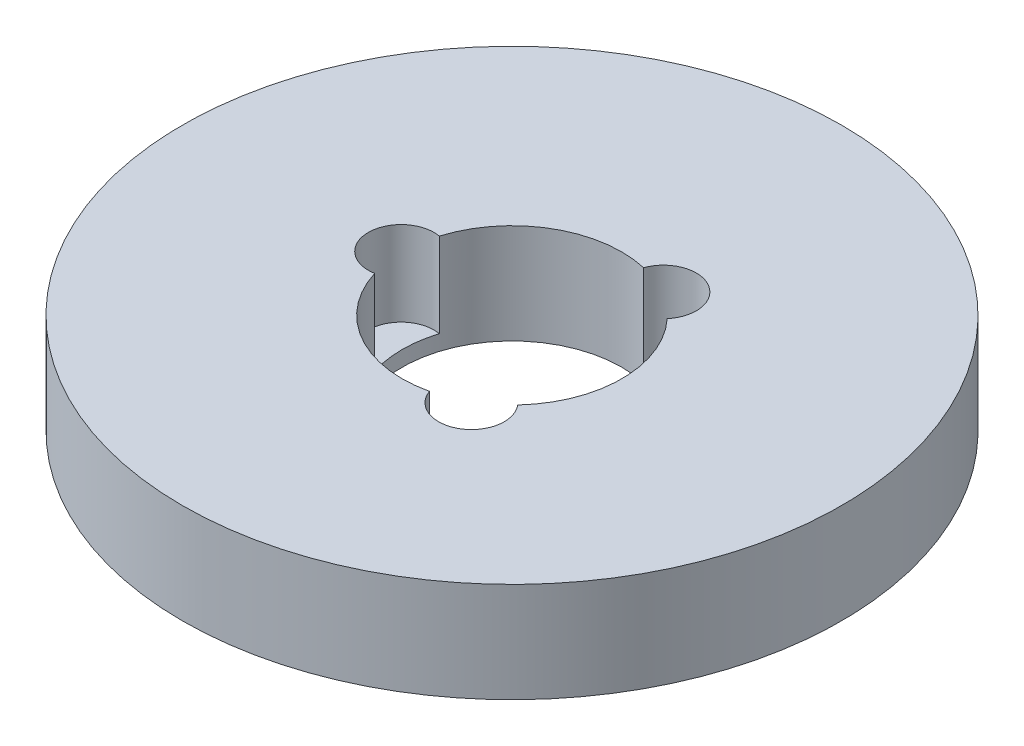
ISO-10303-21;
HEADER;
FILE_DESCRIPTION(('STEP AP214'),'2;1');
FILE_NAME('part.step','',(''),(''),'','','');
FILE_SCHEMA(('AUTOMOTIVE_DESIGN { 1 0 10303 214 1 1 1 1 }'));
ENDSEC;
DATA;
#1=APPLICATION_CONTEXT('core data for automotive mechanical design processes');
#2=APPLICATION_PROTOCOL_DEFINITION('international standard','automotive_design',2000,#1);
#3=PRODUCT_CONTEXT('',#1,'mechanical');
#4=PRODUCT('Part','Part','',(#3));
#5=PRODUCT_RELATED_PRODUCT_CATEGORY('part','',(#4));
#6=PRODUCT_DEFINITION_FORMATION('','',#4);
#7=PRODUCT_DEFINITION_CONTEXT('part definition',#1,'design');
#8=PRODUCT_DEFINITION('design','',#6,#7);
#9=PRODUCT_DEFINITION_SHAPE('','',#8);
#10=(LENGTH_UNIT() NAMED_UNIT(*) SI_UNIT(.MILLI.,.METRE.));
#11=(NAMED_UNIT(*) PLANE_ANGLE_UNIT() SI_UNIT($,.RADIAN.));
#12=(NAMED_UNIT(*) SI_UNIT($,.STERADIAN.) SOLID_ANGLE_UNIT());
#13=UNCERTAINTY_MEASURE_WITH_UNIT(LENGTH_MEASURE(1.E-05),#10,'distance_accuracy_value','');
#14=(GEOMETRIC_REPRESENTATION_CONTEXT(3) GLOBAL_UNCERTAINTY_ASSIGNED_CONTEXT((#13)) GLOBAL_UNIT_ASSIGNED_CONTEXT((#10,
#11,#12)) REPRESENTATION_CONTEXT('',''));
#15=CARTESIAN_POINT('',(0.,0.,0.));
#16=DIRECTION('',(0.,0.,1.));
#17=DIRECTION('',(1.,0.,0.));
#18=AXIS2_PLACEMENT_3D('',#15,#16,#17);
#19=CARTESIAN_POINT('',(0.,25.,0.));
#20=DIRECTION('',(0.,-1.,0.));
#21=DIRECTION('',(0.,0.,-1.));
#22=AXIS2_PLACEMENT_3D('',#19,#20,#21);
#23=CYLINDRICAL_SURFACE('',#22,82.5);
#24=CARTESIAN_POINT('',(0.,25.,0.));
#25=DIRECTION('',(0.,1.,0.));
#26=DIRECTION('',(0.,0.,1.));
#27=AXIS2_PLACEMENT_3D('',#24,#25,#26);
#28=CIRCLE('',#27,82.5);
#29=CARTESIAN_POINT('',(0.,25.,82.5));
#30=VERTEX_POINT('',#29);
#31=EDGE_CURVE('E126',#30,#30,#28,.T.);
#32=ORIENTED_EDGE('',*,*,#31,.F.);
#33=EDGE_LOOP('',(#32));
#34=FACE_BOUND('',#33,.T.);
#35=CARTESIAN_POINT('',(0.,0.,0.));
#36=DIRECTION('',(0.,1.,0.));
#37=DIRECTION('',(0.,0.,1.));
#38=AXIS2_PLACEMENT_3D('',#35,#36,#37);
#39=CIRCLE('',#38,82.5);
#40=CARTESIAN_POINT('',(0.,0.,82.5));
#41=VERTEX_POINT('',#40);
#42=EDGE_CURVE('E124',#41,#41,#39,.T.);
#43=ORIENTED_EDGE('',*,*,#42,.T.);
#44=EDGE_LOOP('',(#43));
#45=FACE_BOUND('',#44,.T.);
#46=ADVANCED_FACE('F39',(#34,#45),#23,.T.);
#47=CARTESIAN_POINT('',(0.,25.,0.));
#48=DIRECTION('',(0.,1.,0.));
#49=DIRECTION('',(0.,0.,1.));
#50=AXIS2_PLACEMENT_3D('',#47,#48,#49);
#51=PLANE('',#50);
#52=CARTESIAN_POINT('',(13.8765047934647,25.,24.0348113337537));
#53=DIRECTION('',(0.,1.,0.));
#54=DIRECTION('',(0.866025403784436,0.,-0.500000000000004));
#55=AXIS2_PLACEMENT_3D('',#52,#53,#54);
#56=CIRCLE('',#55,8.21948386021427);
#57=CARTESIAN_POINT('',(6.13832277785087,25.,26.8061745401114));
#58=VERTEX_POINT('',#57);
#59=CARTESIAN_POINT('',(20.1456667410909,25.,18.719030732303));
#60=VERTEX_POINT('',#59);
#61=EDGE_CURVE('E147',#58,#60,#56,.T.);
#62=ORIENTED_EDGE('',*,*,#61,.F.);
#63=CARTESIAN_POINT('',(0.,25.,0.));
#64=DIRECTION('',(0.,1.,0.));
#65=DIRECTION('',(0.,0.,1.));
#66=AXIS2_PLACEMENT_3D('',#63,#64,#65);
#67=CIRCLE('',#66,27.5);
#68=CARTESIAN_POINT('',(-26.2839895189415,25.,8.08714380780831));
#69=VERTEX_POINT('',#68);
#70=EDGE_CURVE('E118',#69,#58,#67,.T.);
#71=ORIENTED_EDGE('',*,*,#70,.F.);
#72=CARTESIAN_POINT('',(-27.7530095869292,25.,0.));
#73=DIRECTION('',(0.,1.,0.));
#74=DIRECTION('',(0.,0.,1.));
#75=AXIS2_PLACEMENT_3D('',#72,#73,#74);
#76=CIRCLE('',#75,8.21948386021427);
#77=CARTESIAN_POINT('',(-26.2839895189415,25.,-8.08714380780831));
#78=VERTEX_POINT('',#77);
#79=EDGE_CURVE('E113',#78,#69,#76,.T.);
#80=ORIENTED_EDGE('',*,*,#79,.F.);
#81=CARTESIAN_POINT('',(6.1383227778505,25.,-26.8061745401115));
#82=VERTEX_POINT('',#81);
#83=EDGE_CURVE('E106',#82,#78,#67,.T.);
#84=ORIENTED_EDGE('',*,*,#83,.F.);
#85=CARTESIAN_POINT('',(13.8765047934644,25.,-24.0348113337539));
#86=DIRECTION('',(0.,1.,0.));
#87=DIRECTION('',(-0.866025403784443,0.,-0.499999999999992));
#88=AXIS2_PLACEMENT_3D('',#85,#86,#87);
#89=CIRCLE('',#88,8.21948386021427);
#90=CARTESIAN_POINT('',(20.1456667410906,25.,-18.7190307323033));
#91=VERTEX_POINT('',#90);
#92=EDGE_CURVE('E90',#91,#82,#89,.T.);
#93=ORIENTED_EDGE('',*,*,#92,.F.);
#94=EDGE_CURVE('E116',#60,#91,#67,.T.);
#95=ORIENTED_EDGE('',*,*,#94,.F.);
#96=EDGE_LOOP('',(#62,#71,#80,#84,#93,#95));
#97=FACE_BOUND('',#96,.T.);
#98=ORIENTED_EDGE('',*,*,#31,.T.);
#99=EDGE_LOOP('',(#98));
#100=FACE_BOUND('',#99,.T.);
#101=ADVANCED_FACE('F115',(#97,#100),#51,.T.);
#102=CARTESIAN_POINT('',(0.,0.,0.));
#103=DIRECTION('',(0.,1.,0.));
#104=DIRECTION('',(0.,0.,1.));
#105=AXIS2_PLACEMENT_3D('',#102,#103,#104);
#106=PLANE('',#105);
#107=CARTESIAN_POINT('',(0.,0.,0.));
#108=DIRECTION('',(0.,1.,0.));
#109=DIRECTION('',(0.,0.,1.));
#110=AXIS2_PLACEMENT_3D('',#107,#108,#109);
#111=CIRCLE('',#110,27.5);
#112=CARTESIAN_POINT('',(0.,0.,27.5));
#113=VERTEX_POINT('',#112);
#114=EDGE_CURVE('E120',#113,#113,#111,.T.);
#115=ORIENTED_EDGE('',*,*,#114,.T.);
#116=EDGE_LOOP('',(#115));
#117=FACE_BOUND('',#116,.T.);
#118=ORIENTED_EDGE('',*,*,#42,.F.);
#119=EDGE_LOOP('',(#118));
#120=FACE_BOUND('',#119,.T.);
#121=ADVANCED_FACE('F164',(#117,#120),#106,.F.);
#122=CARTESIAN_POINT('',(0.,25.,0.));
#123=DIRECTION('',(0.,-1.,0.));
#124=DIRECTION('',(0.,0.,-1.));
#125=AXIS2_PLACEMENT_3D('',#122,#123,#124);
#126=CYLINDRICAL_SURFACE('',#125,27.5);
#127=DIRECTION('',(0.,1.,0.));
#128=VECTOR('',#127,1.);
#129=CARTESIAN_POINT('',(6.13832277785087,14.4231150029753,26.8061745401114));
#130=LINE('',#129,#128);
#131=CARTESIAN_POINT('',(6.13832277785087,3.84623000595068,26.8061745401114));
#132=VERTEX_POINT('',#131);
#133=EDGE_CURVE('E11',#132,#58,#130,.T.);
#134=ORIENTED_EDGE('',*,*,#133,.F.);
#135=CARTESIAN_POINT('',(0.,3.84623000595068,0.));
#136=DIRECTION('',(0.,1.,0.));
#137=DIRECTION('',(0.,0.,1.));
#138=AXIS2_PLACEMENT_3D('',#135,#136,#137);
#139=CIRCLE('',#138,27.5);
#140=CARTESIAN_POINT('',(20.1456667410909,3.84623000595068,18.719030732303));
#141=VERTEX_POINT('',#140);
#142=EDGE_CURVE('E144',#132,#141,#139,.T.);
#143=ORIENTED_EDGE('',*,*,#142,.T.);
#144=DIRECTION('',(0.,1.,0.));
#145=VECTOR('',#144,1.);
#146=CARTESIAN_POINT('',(20.1456667410909,14.4231150029753,18.719030732303));
#147=LINE('',#146,#145);
#148=EDGE_CURVE('E46',#60,#141,#147,.F.);
#149=ORIENTED_EDGE('',*,*,#148,.F.);
#150=ORIENTED_EDGE('',*,*,#94,.T.);
#151=DIRECTION('',(0.,1.,0.));
#152=VECTOR('',#151,1.);
#153=CARTESIAN_POINT('',(20.1456667410906,14.4231150029753,-18.7190307323033));
#154=LINE('',#153,#152);
#155=CARTESIAN_POINT('',(20.1456667410906,3.84623000595068,-18.7190307323033));
#156=VERTEX_POINT('',#155);
#157=EDGE_CURVE('E92',#156,#91,#154,.T.);
#158=ORIENTED_EDGE('',*,*,#157,.F.);
#159=CARTESIAN_POINT('',(0.,3.84623000595068,0.));
#160=DIRECTION('',(0.,1.,0.));
#161=DIRECTION('',(0.,0.,1.));
#162=AXIS2_PLACEMENT_3D('',#159,#160,#161);
#163=CIRCLE('',#162,27.5);
#164=CARTESIAN_POINT('',(6.1383227778505,3.84623000595068,-26.8061745401115));
#165=VERTEX_POINT('',#164);
#166=EDGE_CURVE('E107',#156,#165,#163,.T.);
#167=ORIENTED_EDGE('',*,*,#166,.T.);
#168=DIRECTION('',(0.,1.,0.));
#169=VECTOR('',#168,1.);
#170=CARTESIAN_POINT('',(6.13832277785049,14.4231150029753,-26.8061745401115));
#171=LINE('',#170,#169);
#172=EDGE_CURVE('E95',#82,#165,#171,.F.);
#173=ORIENTED_EDGE('',*,*,#172,.F.);
#174=ORIENTED_EDGE('',*,*,#83,.T.);
#175=DIRECTION('',(0.,1.,0.));
#176=VECTOR('',#175,1.);
#177=CARTESIAN_POINT('',(-26.2839895189415,14.4231150029753,-8.08714380780831));
#178=LINE('',#177,#176);
#179=CARTESIAN_POINT('',(-26.2839895189415,3.84623000595068,-8.08714380780831));
#180=VERTEX_POINT('',#179);
#181=EDGE_CURVE('E143',#180,#78,#178,.T.);
#182=ORIENTED_EDGE('',*,*,#181,.F.);
#183=CARTESIAN_POINT('',(0.,3.84623000595068,0.));
#184=DIRECTION('',(0.,1.,0.));
#185=DIRECTION('',(0.,0.,1.));
#186=AXIS2_PLACEMENT_3D('',#183,#184,#185);
#187=CIRCLE('',#186,27.5);
#188=CARTESIAN_POINT('',(-26.2839895189415,3.84623000595068,8.08714380780831));
#189=VERTEX_POINT('',#188);
#190=EDGE_CURVE('E132',#180,#189,#187,.T.);
#191=ORIENTED_EDGE('',*,*,#190,.T.);
#192=DIRECTION('',(0.,1.,0.));
#193=VECTOR('',#192,1.);
#194=CARTESIAN_POINT('',(-26.2839895189415,14.4231150029753,8.08714380780831));
#195=LINE('',#194,#193);
#196=EDGE_CURVE('E137',#69,#189,#195,.F.);
#197=ORIENTED_EDGE('',*,*,#196,.F.);
#198=ORIENTED_EDGE('',*,*,#70,.T.);
#199=EDGE_LOOP('',(#134,#143,#149,#150,#158,#167,#173,#174,#182,#191,#197,#198));
#200=FACE_BOUND('',#199,.T.);
#201=ORIENTED_EDGE('',*,*,#114,.F.);
#202=EDGE_LOOP('',(#201));
#203=FACE_BOUND('',#202,.T.);
#204=ADVANCED_FACE('F103',(#200,#203),#126,.F.);
#205=CARTESIAN_POINT('',(-27.7530095869292,3.84623000595068,0.));
#206=DIRECTION('',(0.,1.,0.));
#207=DIRECTION('',(0.,0.,1.));
#208=AXIS2_PLACEMENT_3D('',#205,#206,#207);
#209=CYLINDRICAL_SURFACE('',#208,8.21948386021427);
#210=ORIENTED_EDGE('',*,*,#181,.T.);
#211=ORIENTED_EDGE('',*,*,#79,.T.);
#212=ORIENTED_EDGE('',*,*,#196,.T.);
#213=CARTESIAN_POINT('',(-27.7530095869292,3.84623000595068,0.));
#214=DIRECTION('',(0.,1.,0.));
#215=DIRECTION('',(0.,0.,1.));
#216=AXIS2_PLACEMENT_3D('',#213,#214,#215);
#217=CIRCLE('',#216,8.21948386021427);
#218=EDGE_CURVE('E121',#180,#189,#217,.T.);
#219=ORIENTED_EDGE('',*,*,#218,.F.);
#220=EDGE_LOOP('',(#210,#211,#212,#219));
#221=FACE_BOUND('',#220,.T.);
#222=ADVANCED_FACE('F174',(#221),#209,.F.);
#223=CARTESIAN_POINT('',(-27.7530095869292,3.84623000595068,0.));
#224=DIRECTION('',(0.,1.,0.));
#225=DIRECTION('',(0.,0.,1.));
#226=AXIS2_PLACEMENT_3D('',#223,#224,#225);
#227=PLANE('',#226);
#228=ORIENTED_EDGE('',*,*,#218,.T.);
#229=ORIENTED_EDGE('',*,*,#190,.F.);
#230=EDGE_LOOP('',(#228,#229));
#231=FACE_BOUND('',#230,.T.);
#232=ADVANCED_FACE('F177',(#231),#227,.T.);
#233=CARTESIAN_POINT('',(13.8765047934644,3.84623000595068,-24.0348113337539));
#234=DIRECTION('',(0.,1.,0.));
#235=DIRECTION('',(0.,0.,1.));
#236=AXIS2_PLACEMENT_3D('',#233,#234,#235);
#237=CYLINDRICAL_SURFACE('',#236,8.21948386021427);
#238=ORIENTED_EDGE('',*,*,#157,.T.);
#239=ORIENTED_EDGE('',*,*,#92,.T.);
#240=ORIENTED_EDGE('',*,*,#172,.T.);
#241=CARTESIAN_POINT('',(13.8765047934644,3.84623000595068,-24.0348113337539));
#242=DIRECTION('',(0.,1.,0.));
#243=DIRECTION('',(-0.866025403784443,0.,-0.499999999999992));
#244=AXIS2_PLACEMENT_3D('',#241,#242,#243);
#245=CIRCLE('',#244,8.21948386021427);
#246=EDGE_CURVE('E56',#156,#165,#245,.T.);
#247=ORIENTED_EDGE('',*,*,#246,.F.);
#248=EDGE_LOOP('',(#238,#239,#240,#247));
#249=FACE_BOUND('',#248,.T.);
#250=ADVANCED_FACE('F93',(#249),#237,.F.);
#251=CARTESIAN_POINT('',(13.8765047934644,3.84623000595068,-24.0348113337539));
#252=DIRECTION('',(0.,1.,0.));
#253=DIRECTION('',(-0.866025403784443,0.,-0.499999999999992));
#254=AXIS2_PLACEMENT_3D('',#251,#252,#253);
#255=PLANE('',#254);
#256=ORIENTED_EDGE('',*,*,#246,.T.);
#257=ORIENTED_EDGE('',*,*,#166,.F.);
#258=EDGE_LOOP('',(#256,#257));
#259=FACE_BOUND('',#258,.T.);
#260=ADVANCED_FACE('F160',(#259),#255,.T.);
#261=CARTESIAN_POINT('',(13.8765047934647,3.84623000595068,24.0348113337537));
#262=DIRECTION('',(0.,1.,0.));
#263=DIRECTION('',(0.,0.,1.));
#264=AXIS2_PLACEMENT_3D('',#261,#262,#263);
#265=CYLINDRICAL_SURFACE('',#264,8.21948386021427);
#266=ORIENTED_EDGE('',*,*,#133,.T.);
#267=ORIENTED_EDGE('',*,*,#61,.T.);
#268=ORIENTED_EDGE('',*,*,#148,.T.);
#269=CARTESIAN_POINT('',(13.8765047934647,3.84623000595068,24.0348113337537));
#270=DIRECTION('',(0.,1.,0.));
#271=DIRECTION('',(0.866025403784436,0.,-0.500000000000004));
#272=AXIS2_PLACEMENT_3D('',#269,#270,#271);
#273=CIRCLE('',#272,8.21948386021427);
#274=EDGE_CURVE('E55',#132,#141,#273,.T.);
#275=ORIENTED_EDGE('',*,*,#274,.F.);
#276=EDGE_LOOP('',(#266,#267,#268,#275));
#277=FACE_BOUND('',#276,.T.);
#278=ADVANCED_FACE('F149',(#277),#265,.F.);
#279=CARTESIAN_POINT('',(13.8765047934647,3.84623000595068,24.0348113337537));
#280=DIRECTION('',(0.,1.,0.));
#281=DIRECTION('',(0.866025403784436,0.,-0.500000000000004));
#282=AXIS2_PLACEMENT_3D('',#279,#280,#281);
#283=PLANE('',#282);
#284=ORIENTED_EDGE('',*,*,#274,.T.);
#285=ORIENTED_EDGE('',*,*,#142,.F.);
#286=EDGE_LOOP('',(#284,#285));
#287=FACE_BOUND('',#286,.T.);
#288=ADVANCED_FACE('F151',(#287),#283,.T.);
#289=CLOSED_SHELL('',(#46,#101,#121,#204,#222,#232,#250,#260,#278,#288));
#290=MANIFOLD_SOLID_BREP('B2',#289);
#291=ADVANCED_BREP_SHAPE_REPRESENTATION('',(#18,#290),#14);
#292=SHAPE_DEFINITION_REPRESENTATION(#9,#291);
ENDSEC;
END-ISO-10303-21;
